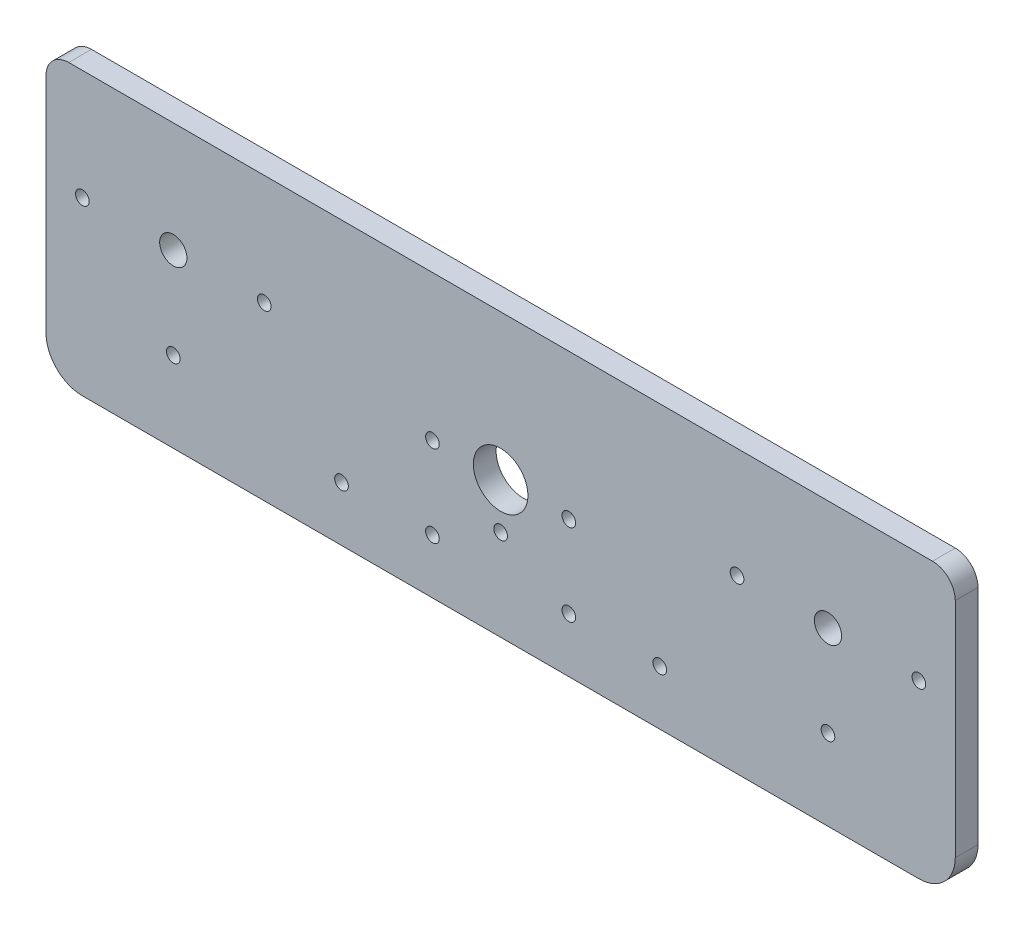
ISO-10303-21;
HEADER;
FILE_DESCRIPTION(('STEP AP214'),'2;1');
FILE_NAME('part.step','',(''),(''),'','','');
FILE_SCHEMA(('AUTOMOTIVE_DESIGN { 1 0 10303 214 1 1 1 1 }'));
ENDSEC;
DATA;
#1=APPLICATION_CONTEXT('core data for automotive mechanical design processes');
#2=APPLICATION_PROTOCOL_DEFINITION('international standard','automotive_design',2000,#1);
#3=PRODUCT_CONTEXT('',#1,'mechanical');
#4=PRODUCT('Part','Part','',(#3));
#5=PRODUCT_RELATED_PRODUCT_CATEGORY('part','',(#4));
#6=PRODUCT_DEFINITION_FORMATION('','',#4);
#7=PRODUCT_DEFINITION_CONTEXT('part definition',#1,'design');
#8=PRODUCT_DEFINITION('design','',#6,#7);
#9=PRODUCT_DEFINITION_SHAPE('','',#8);
#10=(LENGTH_UNIT() NAMED_UNIT(*) SI_UNIT(.MILLI.,.METRE.));
#11=(NAMED_UNIT(*) PLANE_ANGLE_UNIT() SI_UNIT($,.RADIAN.));
#12=(NAMED_UNIT(*) SI_UNIT($,.STERADIAN.) SOLID_ANGLE_UNIT());
#13=UNCERTAINTY_MEASURE_WITH_UNIT(LENGTH_MEASURE(1.E-05),#10,'distance_accuracy_value','');
#14=(GEOMETRIC_REPRESENTATION_CONTEXT(3) GLOBAL_UNCERTAINTY_ASSIGNED_CONTEXT((#13)) GLOBAL_UNIT_ASSIGNED_CONTEXT((#10,
#11,#12)) REPRESENTATION_CONTEXT('',''));
#15=CARTESIAN_POINT('',(0.,0.,0.));
#16=DIRECTION('',(0.,0.,1.));
#17=DIRECTION('',(1.,0.,0.));
#18=AXIS2_PLACEMENT_3D('',#15,#16,#17);
#19=CARTESIAN_POINT('',(-100.,0.,5.));
#20=DIRECTION('',(1.,0.,0.));
#21=DIRECTION('',(0.,0.,-1.));
#22=AXIS2_PLACEMENT_3D('',#19,#20,#21);
#23=PLANE('',#22);
#24=DIRECTION('',(0.,-1.,0.));
#25=VECTOR('',#24,1.);
#26=CARTESIAN_POINT('',(-100.,0.,5.));
#27=LINE('',#26,#25);
#28=CARTESIAN_POINT('',(-100.,0.,5.));
#29=VERTEX_POINT('',#28);
#30=CARTESIAN_POINT('',(-100.,-49.,5.));
#31=VERTEX_POINT('',#30);
#32=EDGE_CURVE('E106',#29,#31,#27,.T.);
#33=ORIENTED_EDGE('',*,*,#32,.F.);
#34=DIRECTION('',(0.,0.,-1.));
#35=VECTOR('',#34,1.);
#36=CARTESIAN_POINT('',(-100.,0.,0.));
#37=LINE('',#36,#35);
#38=CARTESIAN_POINT('',(-100.,0.,0.));
#39=VERTEX_POINT('',#38);
#40=EDGE_CURVE('E11',#29,#39,#37,.T.);
#41=ORIENTED_EDGE('',*,*,#40,.T.);
#42=DIRECTION('',(0.,-1.,0.));
#43=VECTOR('',#42,1.);
#44=CARTESIAN_POINT('',(-100.,0.,0.));
#45=LINE('',#44,#43);
#46=CARTESIAN_POINT('',(-100.,-49.,0.));
#47=VERTEX_POINT('',#46);
#48=EDGE_CURVE('E130',#39,#47,#45,.T.);
#49=ORIENTED_EDGE('',*,*,#48,.T.);
#50=DIRECTION('',(0.,0.,-1.));
#51=VECTOR('',#50,1.);
#52=CARTESIAN_POINT('',(-100.,-49.,5.));
#53=LINE('',#52,#51);
#54=EDGE_CURVE('E123',#31,#47,#53,.T.);
#55=ORIENTED_EDGE('',*,*,#54,.F.);
#56=EDGE_LOOP('',(#33,#41,#49,#55));
#57=FACE_BOUND('',#56,.T.);
#58=ADVANCED_FACE('F41',(#57),#23,.F.);
#59=CARTESIAN_POINT('',(-92.,-49.,5.));
#60=DIRECTION('',(0.,0.,-1.));
#61=DIRECTION('',(-1.,0.,0.));
#62=AXIS2_PLACEMENT_3D('',#59,#60,#61);
#63=CYLINDRICAL_SURFACE('',#62,8.);
#64=CARTESIAN_POINT('',(-92.,-49.,0.));
#65=DIRECTION('',(0.,0.,1.));
#66=DIRECTION('',(1.,0.,0.));
#67=AXIS2_PLACEMENT_3D('',#64,#65,#66);
#68=CIRCLE('',#67,8.);
#69=CARTESIAN_POINT('',(-92.,-57.,0.));
#70=VERTEX_POINT('',#69);
#71=EDGE_CURVE('E262',#47,#70,#68,.T.);
#72=ORIENTED_EDGE('',*,*,#71,.T.);
#73=DIRECTION('',(0.,0.,-1.));
#74=VECTOR('',#73,1.);
#75=CARTESIAN_POINT('',(-92.,-57.,5.));
#76=LINE('',#75,#74);
#77=CARTESIAN_POINT('',(-92.,-57.,5.));
#78=VERTEX_POINT('',#77);
#79=EDGE_CURVE('E124',#78,#70,#76,.T.);
#80=ORIENTED_EDGE('',*,*,#79,.F.);
#81=CARTESIAN_POINT('',(-92.,-49.,5.));
#82=DIRECTION('',(0.,0.,1.));
#83=DIRECTION('',(1.,0.,0.));
#84=AXIS2_PLACEMENT_3D('',#81,#82,#83);
#85=CIRCLE('',#84,8.);
#86=EDGE_CURVE('E111',#31,#78,#85,.T.);
#87=ORIENTED_EDGE('',*,*,#86,.F.);
#88=ORIENTED_EDGE('',*,*,#54,.T.);
#89=EDGE_LOOP('',(#72,#80,#87,#88));
#90=FACE_BOUND('',#89,.T.);
#91=ADVANCED_FACE('F122',(#90),#63,.T.);
#92=CARTESIAN_POINT('',(0.,-57.,5.));
#93=DIRECTION('',(0.,-1.,0.));
#94=DIRECTION('',(1.,0.,0.));
#95=AXIS2_PLACEMENT_3D('',#92,#93,#94);
#96=PLANE('',#95);
#97=DIRECTION('',(-1.,0.,0.));
#98=VECTOR('',#97,1.);
#99=CARTESIAN_POINT('',(0.,-57.,0.));
#100=LINE('',#99,#98);
#101=CARTESIAN_POINT('',(92.,-57.,0.));
#102=VERTEX_POINT('',#101);
#103=EDGE_CURVE('E190',#102,#70,#100,.T.);
#104=ORIENTED_EDGE('',*,*,#103,.F.);
#105=DIRECTION('',(0.,0.,-1.));
#106=VECTOR('',#105,1.);
#107=CARTESIAN_POINT('',(92.,-57.,5.));
#108=LINE('',#107,#106);
#109=CARTESIAN_POINT('',(92.,-57.,5.));
#110=VERTEX_POINT('',#109);
#111=EDGE_CURVE('E139',#110,#102,#108,.T.);
#112=ORIENTED_EDGE('',*,*,#111,.F.);
#113=DIRECTION('',(-1.,0.,0.));
#114=VECTOR('',#113,1.);
#115=CARTESIAN_POINT('',(0.,-57.,5.));
#116=LINE('',#115,#114);
#117=EDGE_CURVE('E127',#110,#78,#116,.T.);
#118=ORIENTED_EDGE('',*,*,#117,.T.);
#119=ORIENTED_EDGE('',*,*,#79,.T.);
#120=EDGE_LOOP('',(#104,#112,#118,#119));
#121=FACE_BOUND('',#120,.T.);
#122=ADVANCED_FACE('F260',(#121),#96,.T.);
#123=CARTESIAN_POINT('',(92.,-49.,5.));
#124=DIRECTION('',(0.,0.,-1.));
#125=DIRECTION('',(-1.,0.,0.));
#126=AXIS2_PLACEMENT_3D('',#123,#124,#125);
#127=CYLINDRICAL_SURFACE('',#126,8.);
#128=CARTESIAN_POINT('',(92.,-49.,0.));
#129=DIRECTION('',(0.,0.,1.));
#130=DIRECTION('',(1.,0.,0.));
#131=AXIS2_PLACEMENT_3D('',#128,#129,#130);
#132=CIRCLE('',#131,8.);
#133=CARTESIAN_POINT('',(100.,-49.,0.));
#134=VERTEX_POINT('',#133);
#135=EDGE_CURVE('E184',#134,#102,#132,.F.);
#136=ORIENTED_EDGE('',*,*,#135,.F.);
#137=DIRECTION('',(0.,0.,-1.));
#138=VECTOR('',#137,1.);
#139=CARTESIAN_POINT('',(100.,-49.,5.));
#140=LINE('',#139,#138);
#141=CARTESIAN_POINT('',(100.,-49.,5.));
#142=VERTEX_POINT('',#141);
#143=EDGE_CURVE('E181',#142,#134,#140,.T.);
#144=ORIENTED_EDGE('',*,*,#143,.F.);
#145=CARTESIAN_POINT('',(92.,-49.,5.));
#146=DIRECTION('',(0.,0.,1.));
#147=DIRECTION('',(1.,0.,0.));
#148=AXIS2_PLACEMENT_3D('',#145,#146,#147);
#149=CIRCLE('',#148,8.);
#150=EDGE_CURVE('E257',#142,#110,#149,.F.);
#151=ORIENTED_EDGE('',*,*,#150,.T.);
#152=ORIENTED_EDGE('',*,*,#111,.T.);
#153=EDGE_LOOP('',(#136,#144,#151,#152));
#154=FACE_BOUND('',#153,.T.);
#155=ADVANCED_FACE('F256',(#154),#127,.T.);
#156=CARTESIAN_POINT('',(100.,0.,5.));
#157=DIRECTION('',(1.,0.,0.));
#158=DIRECTION('',(0.,0.,-1.));
#159=AXIS2_PLACEMENT_3D('',#156,#157,#158);
#160=PLANE('',#159);
#161=DIRECTION('',(0.,-1.,0.));
#162=VECTOR('',#161,1.);
#163=CARTESIAN_POINT('',(100.,0.,0.));
#164=LINE('',#163,#162);
#165=CARTESIAN_POINT('',(100.,0.,0.));
#166=VERTEX_POINT('',#165);
#167=EDGE_CURVE('E176',#166,#134,#164,.T.);
#168=ORIENTED_EDGE('',*,*,#167,.F.);
#169=DIRECTION('',(0.,0.,-1.));
#170=VECTOR('',#169,1.);
#171=CARTESIAN_POINT('',(100.,0.,5.));
#172=LINE('',#171,#170);
#173=CARTESIAN_POINT('',(100.,0.,5.));
#174=VERTEX_POINT('',#173);
#175=EDGE_CURVE('E65',#166,#174,#172,.F.);
#176=ORIENTED_EDGE('',*,*,#175,.T.);
#177=DIRECTION('',(0.,-1.,0.));
#178=VECTOR('',#177,1.);
#179=CARTESIAN_POINT('',(100.,0.,5.));
#180=LINE('',#179,#178);
#181=EDGE_CURVE('E160',#174,#142,#180,.T.);
#182=ORIENTED_EDGE('',*,*,#181,.T.);
#183=ORIENTED_EDGE('',*,*,#143,.T.);
#184=EDGE_LOOP('',(#168,#176,#182,#183));
#185=FACE_BOUND('',#184,.T.);
#186=ADVANCED_FACE('F179',(#185),#160,.T.);
#187=CARTESIAN_POINT('',(-15.,-27.,5.));
#188=DIRECTION('',(0.,0.,-1.));
#189=DIRECTION('',(-1.,0.,0.));
#190=AXIS2_PLACEMENT_3D('',#187,#188,#189);
#191=CYLINDRICAL_SURFACE('',#190,1.5);
#192=CARTESIAN_POINT('',(-15.,-27.,5.));
#193=DIRECTION('',(0.,0.,1.));
#194=DIRECTION('',(1.,0.,0.));
#195=AXIS2_PLACEMENT_3D('',#192,#193,#194);
#196=CIRCLE('',#195,1.5);
#197=CARTESIAN_POINT('',(-13.5,-27.,5.));
#198=VERTEX_POINT('',#197);
#199=EDGE_CURVE('E279',#198,#198,#196,.T.);
#200=ORIENTED_EDGE('',*,*,#199,.T.);
#201=EDGE_LOOP('',(#200));
#202=FACE_BOUND('',#201,.T.);
#203=CARTESIAN_POINT('',(-15.,-27.,0.));
#204=DIRECTION('',(0.,0.,1.));
#205=DIRECTION('',(1.,0.,0.));
#206=AXIS2_PLACEMENT_3D('',#203,#204,#205);
#207=CIRCLE('',#206,1.5);
#208=CARTESIAN_POINT('',(-13.5,-27.,0.));
#209=VERTEX_POINT('',#208);
#210=EDGE_CURVE('E241',#209,#209,#207,.T.);
#211=ORIENTED_EDGE('',*,*,#210,.F.);
#212=EDGE_LOOP('',(#211));
#213=FACE_BOUND('',#212,.T.);
#214=ADVANCED_FACE('F383',(#202,#213),#191,.F.);
#215=CARTESIAN_POINT('',(-35.,-45.,5.));
#216=DIRECTION('',(0.,0.,-1.));
#217=DIRECTION('',(-1.,0.,0.));
#218=AXIS2_PLACEMENT_3D('',#215,#216,#217);
#219=CYLINDRICAL_SURFACE('',#218,1.5);
#220=CARTESIAN_POINT('',(-35.,-45.,5.));
#221=DIRECTION('',(0.,0.,1.));
#222=DIRECTION('',(1.,0.,0.));
#223=AXIS2_PLACEMENT_3D('',#220,#221,#222);
#224=CIRCLE('',#223,1.5);
#225=CARTESIAN_POINT('',(-33.5,-45.,5.));
#226=VERTEX_POINT('',#225);
#227=EDGE_CURVE('E283',#226,#226,#224,.F.);
#228=ORIENTED_EDGE('',*,*,#227,.F.);
#229=EDGE_LOOP('',(#228));
#230=FACE_BOUND('',#229,.T.);
#231=CARTESIAN_POINT('',(-35.,-45.,0.));
#232=DIRECTION('',(0.,0.,1.));
#233=DIRECTION('',(1.,0.,0.));
#234=AXIS2_PLACEMENT_3D('',#231,#232,#233);
#235=CIRCLE('',#234,1.5);
#236=CARTESIAN_POINT('',(-33.5,-45.,0.));
#237=VERTEX_POINT('',#236);
#238=EDGE_CURVE('E237',#237,#237,#235,.F.);
#239=ORIENTED_EDGE('',*,*,#238,.T.);
#240=EDGE_LOOP('',(#239));
#241=FACE_BOUND('',#240,.T.);
#242=ADVANCED_FACE('F386',(#230,#241),#219,.F.);
#243=CARTESIAN_POINT('',(35.,-45.,5.));
#244=DIRECTION('',(0.,0.,-1.));
#245=DIRECTION('',(-1.,0.,0.));
#246=AXIS2_PLACEMENT_3D('',#243,#244,#245);
#247=CYLINDRICAL_SURFACE('',#246,1.5);
#248=CARTESIAN_POINT('',(35.,-45.,5.));
#249=DIRECTION('',(0.,0.,1.));
#250=DIRECTION('',(1.,0.,0.));
#251=AXIS2_PLACEMENT_3D('',#248,#249,#250);
#252=CIRCLE('',#251,1.5);
#253=CARTESIAN_POINT('',(36.5,-45.,5.));
#254=VERTEX_POINT('',#253);
#255=EDGE_CURVE('E287',#254,#254,#252,.T.);
#256=ORIENTED_EDGE('',*,*,#255,.T.);
#257=EDGE_LOOP('',(#256));
#258=FACE_BOUND('',#257,.T.);
#259=CARTESIAN_POINT('',(35.,-45.,0.));
#260=DIRECTION('',(0.,0.,1.));
#261=DIRECTION('',(1.,0.,0.));
#262=AXIS2_PLACEMENT_3D('',#259,#260,#261);
#263=CIRCLE('',#262,1.5);
#264=CARTESIAN_POINT('',(36.5,-45.,0.));
#265=VERTEX_POINT('',#264);
#266=EDGE_CURVE('E233',#265,#265,#263,.T.);
#267=ORIENTED_EDGE('',*,*,#266,.F.);
#268=EDGE_LOOP('',(#267));
#269=FACE_BOUND('',#268,.T.);
#270=ADVANCED_FACE('F390',(#258,#269),#247,.F.);
#271=CARTESIAN_POINT('',(15.,-45.,5.));
#272=DIRECTION('',(0.,0.,-1.));
#273=DIRECTION('',(-1.,0.,0.));
#274=AXIS2_PLACEMENT_3D('',#271,#272,#273);
#275=CYLINDRICAL_SURFACE('',#274,1.5);
#276=CARTESIAN_POINT('',(15.,-45.,5.));
#277=DIRECTION('',(0.,0.,1.));
#278=DIRECTION('',(1.,0.,0.));
#279=AXIS2_PLACEMENT_3D('',#276,#277,#278);
#280=CIRCLE('',#279,1.5);
#281=CARTESIAN_POINT('',(16.5,-45.,5.));
#282=VERTEX_POINT('',#281);
#283=EDGE_CURVE('E291',#282,#282,#280,.T.);
#284=ORIENTED_EDGE('',*,*,#283,.T.);
#285=EDGE_LOOP('',(#284));
#286=FACE_BOUND('',#285,.T.);
#287=CARTESIAN_POINT('',(15.,-45.,0.));
#288=DIRECTION('',(0.,0.,1.));
#289=DIRECTION('',(1.,0.,0.));
#290=AXIS2_PLACEMENT_3D('',#287,#288,#289);
#291=CIRCLE('',#290,1.5);
#292=CARTESIAN_POINT('',(16.5,-45.,0.));
#293=VERTEX_POINT('',#292);
#294=EDGE_CURVE('E229',#293,#293,#291,.T.);
#295=ORIENTED_EDGE('',*,*,#294,.F.);
#296=EDGE_LOOP('',(#295));
#297=FACE_BOUND('',#296,.T.);
#298=ADVANCED_FACE('F394',(#286,#297),#275,.F.);
#299=CARTESIAN_POINT('',(-52.,-19.25,5.));
#300=DIRECTION('',(0.,0.,-1.));
#301=DIRECTION('',(-1.,0.,0.));
#302=AXIS2_PLACEMENT_3D('',#299,#300,#301);
#303=CYLINDRICAL_SURFACE('',#302,1.5);
#304=CARTESIAN_POINT('',(-52.,-19.25,5.));
#305=DIRECTION('',(0.,0.,1.));
#306=DIRECTION('',(1.,0.,0.));
#307=AXIS2_PLACEMENT_3D('',#304,#305,#306);
#308=CIRCLE('',#307,1.5);
#309=CARTESIAN_POINT('',(-50.5,-19.25,5.));
#310=VERTEX_POINT('',#309);
#311=EDGE_CURVE('E295',#310,#310,#308,.F.);
#312=ORIENTED_EDGE('',*,*,#311,.F.);
#313=EDGE_LOOP('',(#312));
#314=FACE_BOUND('',#313,.T.);
#315=CARTESIAN_POINT('',(-52.,-19.25,0.));
#316=DIRECTION('',(0.,0.,1.));
#317=DIRECTION('',(1.,0.,0.));
#318=AXIS2_PLACEMENT_3D('',#315,#316,#317);
#319=CIRCLE('',#318,1.5);
#320=CARTESIAN_POINT('',(-50.5,-19.25,0.));
#321=VERTEX_POINT('',#320);
#322=EDGE_CURVE('E225',#321,#321,#319,.F.);
#323=ORIENTED_EDGE('',*,*,#322,.T.);
#324=EDGE_LOOP('',(#323));
#325=FACE_BOUND('',#324,.T.);
#326=ADVANCED_FACE('F398',(#314,#325),#303,.F.);
#327=CARTESIAN_POINT('',(-92.,-19.25,5.));
#328=DIRECTION('',(0.,0.,-1.));
#329=DIRECTION('',(-1.,0.,0.));
#330=AXIS2_PLACEMENT_3D('',#327,#328,#329);
#331=CYLINDRICAL_SURFACE('',#330,1.5);
#332=CARTESIAN_POINT('',(-92.,-19.25,5.));
#333=DIRECTION('',(0.,0.,1.));
#334=DIRECTION('',(1.,0.,0.));
#335=AXIS2_PLACEMENT_3D('',#332,#333,#334);
#336=CIRCLE('',#335,1.5);
#337=CARTESIAN_POINT('',(-90.5,-19.25,5.));
#338=VERTEX_POINT('',#337);
#339=EDGE_CURVE('E299',#338,#338,#336,.T.);
#340=ORIENTED_EDGE('',*,*,#339,.T.);
#341=EDGE_LOOP('',(#340));
#342=FACE_BOUND('',#341,.T.);
#343=CARTESIAN_POINT('',(-92.,-19.25,0.));
#344=DIRECTION('',(0.,0.,1.));
#345=DIRECTION('',(1.,0.,0.));
#346=AXIS2_PLACEMENT_3D('',#343,#344,#345);
#347=CIRCLE('',#346,1.5);
#348=CARTESIAN_POINT('',(-90.5,-19.25,0.));
#349=VERTEX_POINT('',#348);
#350=EDGE_CURVE('E221',#349,#349,#347,.T.);
#351=ORIENTED_EDGE('',*,*,#350,.F.);
#352=EDGE_LOOP('',(#351));
#353=FACE_BOUND('',#352,.T.);
#354=ADVANCED_FACE('F402',(#342,#353),#331,.F.);
#355=CARTESIAN_POINT('',(92.,-19.25,5.));
#356=DIRECTION('',(0.,0.,-1.));
#357=DIRECTION('',(-1.,0.,0.));
#358=AXIS2_PLACEMENT_3D('',#355,#356,#357);
#359=CYLINDRICAL_SURFACE('',#358,1.5);
#360=CARTESIAN_POINT('',(92.,-19.25,5.));
#361=DIRECTION('',(0.,0.,1.));
#362=DIRECTION('',(1.,0.,0.));
#363=AXIS2_PLACEMENT_3D('',#360,#361,#362);
#364=CIRCLE('',#363,1.5);
#365=CARTESIAN_POINT('',(93.5,-19.25,5.));
#366=VERTEX_POINT('',#365);
#367=EDGE_CURVE('E303',#366,#366,#364,.F.);
#368=ORIENTED_EDGE('',*,*,#367,.F.);
#369=EDGE_LOOP('',(#368));
#370=FACE_BOUND('',#369,.T.);
#371=CARTESIAN_POINT('',(92.,-19.25,0.));
#372=DIRECTION('',(0.,0.,1.));
#373=DIRECTION('',(1.,0.,0.));
#374=AXIS2_PLACEMENT_3D('',#371,#372,#373);
#375=CIRCLE('',#374,1.5);
#376=CARTESIAN_POINT('',(93.5,-19.25,0.));
#377=VERTEX_POINT('',#376);
#378=EDGE_CURVE('E217',#377,#377,#375,.F.);
#379=ORIENTED_EDGE('',*,*,#378,.T.);
#380=EDGE_LOOP('',(#379));
#381=FACE_BOUND('',#380,.T.);
#382=ADVANCED_FACE('F406',(#370,#381),#359,.F.);
#383=CARTESIAN_POINT('',(52.,-19.25,5.));
#384=DIRECTION('',(0.,0.,-1.));
#385=DIRECTION('',(-1.,0.,0.));
#386=AXIS2_PLACEMENT_3D('',#383,#384,#385);
#387=CYLINDRICAL_SURFACE('',#386,1.5);
#388=CARTESIAN_POINT('',(52.,-19.25,5.));
#389=DIRECTION('',(0.,0.,1.));
#390=DIRECTION('',(1.,0.,0.));
#391=AXIS2_PLACEMENT_3D('',#388,#389,#390);
#392=CIRCLE('',#391,1.5);
#393=CARTESIAN_POINT('',(53.5,-19.25,5.));
#394=VERTEX_POINT('',#393);
#395=EDGE_CURVE('E307',#394,#394,#392,.T.);
#396=ORIENTED_EDGE('',*,*,#395,.T.);
#397=EDGE_LOOP('',(#396));
#398=FACE_BOUND('',#397,.T.);
#399=CARTESIAN_POINT('',(52.,-19.25,0.));
#400=DIRECTION('',(0.,0.,1.));
#401=DIRECTION('',(1.,0.,0.));
#402=AXIS2_PLACEMENT_3D('',#399,#400,#401);
#403=CIRCLE('',#402,1.5);
#404=CARTESIAN_POINT('',(53.5,-19.25,0.));
#405=VERTEX_POINT('',#404);
#406=EDGE_CURVE('E213',#405,#405,#403,.T.);
#407=ORIENTED_EDGE('',*,*,#406,.F.);
#408=EDGE_LOOP('',(#407));
#409=FACE_BOUND('',#408,.T.);
#410=ADVANCED_FACE('F410',(#398,#409),#387,.F.);
#411=CARTESIAN_POINT('',(72.,-39.25,5.));
#412=DIRECTION('',(0.,0.,-1.));
#413=DIRECTION('',(-1.,0.,0.));
#414=AXIS2_PLACEMENT_3D('',#411,#412,#413);
#415=CYLINDRICAL_SURFACE('',#414,1.5);
#416=CARTESIAN_POINT('',(72.,-39.25,5.));
#417=DIRECTION('',(0.,0.,1.));
#418=DIRECTION('',(1.,0.,0.));
#419=AXIS2_PLACEMENT_3D('',#416,#417,#418);
#420=CIRCLE('',#419,1.5);
#421=CARTESIAN_POINT('',(73.5,-39.25,5.));
#422=VERTEX_POINT('',#421);
#423=EDGE_CURVE('E311',#422,#422,#420,.T.);
#424=ORIENTED_EDGE('',*,*,#423,.T.);
#425=EDGE_LOOP('',(#424));
#426=FACE_BOUND('',#425,.T.);
#427=CARTESIAN_POINT('',(72.,-39.25,0.));
#428=DIRECTION('',(0.,0.,1.));
#429=DIRECTION('',(1.,0.,0.));
#430=AXIS2_PLACEMENT_3D('',#427,#428,#429);
#431=CIRCLE('',#430,1.5);
#432=CARTESIAN_POINT('',(73.5,-39.25,0.));
#433=VERTEX_POINT('',#432);
#434=EDGE_CURVE('E209',#433,#433,#431,.T.);
#435=ORIENTED_EDGE('',*,*,#434,.F.);
#436=EDGE_LOOP('',(#435));
#437=FACE_BOUND('',#436,.T.);
#438=ADVANCED_FACE('F414',(#426,#437),#415,.F.);
#439=CARTESIAN_POINT('',(0.,-27.,5.));
#440=DIRECTION('',(0.,0.,-1.));
#441=DIRECTION('',(-1.,0.,0.));
#442=AXIS2_PLACEMENT_3D('',#439,#440,#441);
#443=CYLINDRICAL_SURFACE('',#442,6.);
#444=CARTESIAN_POINT('',(0.,-27.,5.));
#445=DIRECTION('',(0.,0.,1.));
#446=DIRECTION('',(1.,0.,0.));
#447=AXIS2_PLACEMENT_3D('',#444,#445,#446);
#448=CIRCLE('',#447,6.);
#449=CARTESIAN_POINT('',(6.,-27.,5.));
#450=VERTEX_POINT('',#449);
#451=EDGE_CURVE('E315',#450,#450,#448,.T.);
#452=ORIENTED_EDGE('',*,*,#451,.T.);
#453=EDGE_LOOP('',(#452));
#454=FACE_BOUND('',#453,.T.);
#455=CARTESIAN_POINT('',(0.,-27.,0.));
#456=DIRECTION('',(0.,0.,1.));
#457=DIRECTION('',(1.,0.,0.));
#458=AXIS2_PLACEMENT_3D('',#455,#456,#457);
#459=CIRCLE('',#458,6.);
#460=CARTESIAN_POINT('',(6.,-27.,0.));
#461=VERTEX_POINT('',#460);
#462=EDGE_CURVE('E205',#461,#461,#459,.T.);
#463=ORIENTED_EDGE('',*,*,#462,.F.);
#464=EDGE_LOOP('',(#463));
#465=FACE_BOUND('',#464,.T.);
#466=ADVANCED_FACE('F418',(#454,#465),#443,.F.);
#467=CARTESIAN_POINT('',(72.,-19.25,5.));
#468=DIRECTION('',(0.,0.,-1.));
#469=DIRECTION('',(-1.,0.,0.));
#470=AXIS2_PLACEMENT_3D('',#467,#468,#469);
#471=CYLINDRICAL_SURFACE('',#470,3.00000000000001);
#472=CARTESIAN_POINT('',(72.,-19.25,5.));
#473=DIRECTION('',(0.,0.,1.));
#474=DIRECTION('',(1.,0.,0.));
#475=AXIS2_PLACEMENT_3D('',#472,#473,#474);
#476=CIRCLE('',#475,3.00000000000001);
#477=CARTESIAN_POINT('',(75.,-19.25,5.));
#478=VERTEX_POINT('',#477);
#479=EDGE_CURVE('E319',#478,#478,#476,.T.);
#480=ORIENTED_EDGE('',*,*,#479,.T.);
#481=EDGE_LOOP('',(#480));
#482=FACE_BOUND('',#481,.T.);
#483=CARTESIAN_POINT('',(72.,-19.25,0.));
#484=DIRECTION('',(0.,0.,1.));
#485=DIRECTION('',(1.,0.,0.));
#486=AXIS2_PLACEMENT_3D('',#483,#484,#485);
#487=CIRCLE('',#486,3.00000000000001);
#488=CARTESIAN_POINT('',(75.,-19.25,0.));
#489=VERTEX_POINT('',#488);
#490=EDGE_CURVE('E201',#489,#489,#487,.T.);
#491=ORIENTED_EDGE('',*,*,#490,.F.);
#492=EDGE_LOOP('',(#491));
#493=FACE_BOUND('',#492,.T.);
#494=ADVANCED_FACE('F422',(#482,#493),#471,.F.);
#495=CARTESIAN_POINT('',(-72.,-19.25,5.));
#496=DIRECTION('',(0.,0.,-1.));
#497=DIRECTION('',(-1.,0.,0.));
#498=AXIS2_PLACEMENT_3D('',#495,#496,#497);
#499=CYLINDRICAL_SURFACE('',#498,3.00000000000001);
#500=CARTESIAN_POINT('',(-72.,-19.25,5.));
#501=DIRECTION('',(0.,0.,1.));
#502=DIRECTION('',(1.,0.,0.));
#503=AXIS2_PLACEMENT_3D('',#500,#501,#502);
#504=CIRCLE('',#503,3.00000000000001);
#505=CARTESIAN_POINT('',(-69.,-19.25,5.));
#506=VERTEX_POINT('',#505);
#507=EDGE_CURVE('E323',#506,#506,#504,.F.);
#508=ORIENTED_EDGE('',*,*,#507,.F.);
#509=EDGE_LOOP('',(#508));
#510=FACE_BOUND('',#509,.T.);
#511=CARTESIAN_POINT('',(-72.,-19.25,0.));
#512=DIRECTION('',(0.,0.,1.));
#513=DIRECTION('',(1.,0.,0.));
#514=AXIS2_PLACEMENT_3D('',#511,#512,#513);
#515=CIRCLE('',#514,3.00000000000001);
#516=CARTESIAN_POINT('',(-69.,-19.25,0.));
#517=VERTEX_POINT('',#516);
#518=EDGE_CURVE('E197',#517,#517,#515,.F.);
#519=ORIENTED_EDGE('',*,*,#518,.T.);
#520=EDGE_LOOP('',(#519));
#521=FACE_BOUND('',#520,.T.);
#522=ADVANCED_FACE('F426',(#510,#521),#499,.F.);
#523=CARTESIAN_POINT('',(-72.,-39.25,5.));
#524=DIRECTION('',(0.,0.,-1.));
#525=DIRECTION('',(-1.,0.,0.));
#526=AXIS2_PLACEMENT_3D('',#523,#524,#525);
#527=CYLINDRICAL_SURFACE('',#526,1.5);
#528=CARTESIAN_POINT('',(-72.,-39.25,5.));
#529=DIRECTION('',(0.,0.,1.));
#530=DIRECTION('',(1.,0.,0.));
#531=AXIS2_PLACEMENT_3D('',#528,#529,#530);
#532=CIRCLE('',#531,1.5);
#533=CARTESIAN_POINT('',(-70.5,-39.25,5.));
#534=VERTEX_POINT('',#533);
#535=EDGE_CURVE('E169',#534,#534,#532,.F.);
#536=ORIENTED_EDGE('',*,*,#535,.F.);
#537=EDGE_LOOP('',(#536));
#538=FACE_BOUND('',#537,.T.);
#539=CARTESIAN_POINT('',(-72.,-39.25,0.));
#540=DIRECTION('',(0.,0.,1.));
#541=DIRECTION('',(1.,0.,0.));
#542=AXIS2_PLACEMENT_3D('',#539,#540,#541);
#543=CIRCLE('',#542,1.5);
#544=CARTESIAN_POINT('',(-70.5,-39.25,0.));
#545=VERTEX_POINT('',#544);
#546=EDGE_CURVE('E188',#545,#545,#543,.F.);
#547=ORIENTED_EDGE('',*,*,#546,.T.);
#548=EDGE_LOOP('',(#547));
#549=FACE_BOUND('',#548,.T.);
#550=ADVANCED_FACE('F430',(#538,#549),#527,.F.);
#551=CARTESIAN_POINT('',(0.,5.00000000000001,5.));
#552=DIRECTION('',(0.,1.,0.));
#553=DIRECTION('',(-1.,0.,0.));
#554=AXIS2_PLACEMENT_3D('',#551,#552,#553);
#555=PLANE('',#554);
#556=DIRECTION('',(1.,0.,0.));
#557=VECTOR('',#556,1.);
#558=CARTESIAN_POINT('',(0.,5.00000000000001,5.));
#559=LINE('',#558,#557);
#560=CARTESIAN_POINT('',(-95.,5.,5.));
#561=VERTEX_POINT('',#560);
#562=CARTESIAN_POINT('',(95.,5.00000000000002,5.));
#563=VERTEX_POINT('',#562);
#564=EDGE_CURVE('E158',#561,#563,#559,.T.);
#565=ORIENTED_EDGE('',*,*,#564,.T.);
#566=DIRECTION('',(0.,0.,-1.));
#567=VECTOR('',#566,1.);
#568=CARTESIAN_POINT('',(95.,5.00000000000002,5.));
#569=LINE('',#568,#567);
#570=CARTESIAN_POINT('',(95.,5.00000000000002,0.));
#571=VERTEX_POINT('',#570);
#572=EDGE_CURVE('E137',#563,#571,#569,.T.);
#573=ORIENTED_EDGE('',*,*,#572,.T.);
#574=DIRECTION('',(1.,0.,0.));
#575=VECTOR('',#574,1.);
#576=CARTESIAN_POINT('',(0.,5.00000000000001,0.));
#577=LINE('',#576,#575);
#578=CARTESIAN_POINT('',(-95.,5.,0.));
#579=VERTEX_POINT('',#578);
#580=EDGE_CURVE('E178',#579,#571,#577,.T.);
#581=ORIENTED_EDGE('',*,*,#580,.F.);
#582=DIRECTION('',(0.,0.,-1.));
#583=VECTOR('',#582,1.);
#584=CARTESIAN_POINT('',(-95.,5.,5.));
#585=LINE('',#584,#583);
#586=EDGE_CURVE('E133',#579,#561,#585,.F.);
#587=ORIENTED_EDGE('',*,*,#586,.T.);
#588=EDGE_LOOP('',(#565,#573,#581,#587));
#589=FACE_BOUND('',#588,.T.);
#590=ADVANCED_FACE('F164',(#589),#555,.T.);
#591=CARTESIAN_POINT('',(-15.,-45.,5.));
#592=DIRECTION('',(0.,0.,-1.));
#593=DIRECTION('',(-1.,0.,0.));
#594=AXIS2_PLACEMENT_3D('',#591,#592,#593);
#595=CYLINDRICAL_SURFACE('',#594,1.5);
#596=CARTESIAN_POINT('',(-15.,-45.,5.));
#597=DIRECTION('',(0.,0.,1.));
#598=DIRECTION('',(1.,0.,0.));
#599=AXIS2_PLACEMENT_3D('',#596,#597,#598);
#600=CIRCLE('',#599,1.5);
#601=CARTESIAN_POINT('',(-13.5,-45.,5.));
#602=VERTEX_POINT('',#601);
#603=EDGE_CURVE('E117',#602,#602,#600,.F.);
#604=ORIENTED_EDGE('',*,*,#603,.F.);
#605=EDGE_LOOP('',(#604));
#606=FACE_BOUND('',#605,.T.);
#607=CARTESIAN_POINT('',(-15.,-45.,0.));
#608=DIRECTION('',(0.,0.,1.));
#609=DIRECTION('',(1.,0.,0.));
#610=AXIS2_PLACEMENT_3D('',#607,#608,#609);
#611=CIRCLE('',#610,1.5);
#612=CARTESIAN_POINT('',(-13.5,-45.,0.));
#613=VERTEX_POINT('',#612);
#614=EDGE_CURVE('E268',#613,#613,#611,.F.);
#615=ORIENTED_EDGE('',*,*,#614,.T.);
#616=EDGE_LOOP('',(#615));
#617=FACE_BOUND('',#616,.T.);
#618=ADVANCED_FACE('F352',(#606,#617),#595,.F.);
#619=CARTESIAN_POINT('',(0.,-37.,5.));
#620=DIRECTION('',(0.,0.,-1.));
#621=DIRECTION('',(-1.,0.,0.));
#622=AXIS2_PLACEMENT_3D('',#619,#620,#621);
#623=CYLINDRICAL_SURFACE('',#622,1.5);
#624=CARTESIAN_POINT('',(0.,-37.,5.));
#625=DIRECTION('',(0.,0.,1.));
#626=DIRECTION('',(1.,0.,0.));
#627=AXIS2_PLACEMENT_3D('',#624,#625,#626);
#628=CIRCLE('',#627,1.5);
#629=CARTESIAN_POINT('',(1.50000000000001,-37.,5.));
#630=VERTEX_POINT('',#629);
#631=EDGE_CURVE('E249',#630,#630,#628,.T.);
#632=ORIENTED_EDGE('',*,*,#631,.T.);
#633=EDGE_LOOP('',(#632));
#634=FACE_BOUND('',#633,.T.);
#635=CARTESIAN_POINT('',(0.,-37.,0.));
#636=DIRECTION('',(0.,0.,1.));
#637=DIRECTION('',(1.,0.,0.));
#638=AXIS2_PLACEMENT_3D('',#635,#636,#637);
#639=CIRCLE('',#638,1.5);
#640=CARTESIAN_POINT('',(1.50000000000001,-37.,0.));
#641=VERTEX_POINT('',#640);
#642=EDGE_CURVE('E272',#641,#641,#639,.T.);
#643=ORIENTED_EDGE('',*,*,#642,.F.);
#644=EDGE_LOOP('',(#643));
#645=FACE_BOUND('',#644,.T.);
#646=ADVANCED_FACE('F343',(#634,#645),#623,.F.);
#647=CARTESIAN_POINT('',(15.,-27.,5.));
#648=DIRECTION('',(0.,0.,-1.));
#649=DIRECTION('',(-1.,0.,0.));
#650=AXIS2_PLACEMENT_3D('',#647,#648,#649);
#651=CYLINDRICAL_SURFACE('',#650,1.5);
#652=CARTESIAN_POINT('',(15.,-27.,5.));
#653=DIRECTION('',(0.,0.,1.));
#654=DIRECTION('',(1.,0.,0.));
#655=AXIS2_PLACEMENT_3D('',#652,#653,#654);
#656=CIRCLE('',#655,1.5);
#657=CARTESIAN_POINT('',(16.5,-27.,5.));
#658=VERTEX_POINT('',#657);
#659=EDGE_CURVE('E251',#658,#658,#656,.F.);
#660=ORIENTED_EDGE('',*,*,#659,.F.);
#661=EDGE_LOOP('',(#660));
#662=FACE_BOUND('',#661,.T.);
#663=CARTESIAN_POINT('',(15.,-27.,0.));
#664=DIRECTION('',(0.,0.,1.));
#665=DIRECTION('',(1.,0.,0.));
#666=AXIS2_PLACEMENT_3D('',#663,#664,#665);
#667=CIRCLE('',#666,1.5);
#668=CARTESIAN_POINT('',(16.5,-27.,0.));
#669=VERTEX_POINT('',#668);
#670=EDGE_CURVE('E245',#669,#669,#667,.F.);
#671=ORIENTED_EDGE('',*,*,#670,.T.);
#672=EDGE_LOOP('',(#671));
#673=FACE_BOUND('',#672,.T.);
#674=ADVANCED_FACE('F348',(#662,#673),#651,.F.);
#675=CARTESIAN_POINT('',(0.,0.,5.));
#676=DIRECTION('',(0.,0.,1.));
#677=DIRECTION('',(1.,0.,0.));
#678=AXIS2_PLACEMENT_3D('',#675,#676,#677);
#679=PLANE('',#678);
#680=ORIENTED_EDGE('',*,*,#631,.F.);
#681=EDGE_LOOP('',(#680));
#682=FACE_BOUND('',#681,.T.);
#683=ORIENTED_EDGE('',*,*,#603,.T.);
#684=EDGE_LOOP('',(#683));
#685=FACE_BOUND('',#684,.T.);
#686=ORIENTED_EDGE('',*,*,#181,.F.);
#687=CARTESIAN_POINT('',(95.,0.,5.));
#688=DIRECTION('',(0.,0.,1.));
#689=DIRECTION('',(1.,0.,0.));
#690=AXIS2_PLACEMENT_3D('',#687,#688,#689);
#691=CIRCLE('',#690,5.);
#692=EDGE_CURVE('E50',#174,#563,#691,.T.);
#693=ORIENTED_EDGE('',*,*,#692,.T.);
#694=ORIENTED_EDGE('',*,*,#564,.F.);
#695=CARTESIAN_POINT('',(-95.,0.,5.));
#696=DIRECTION('',(0.,0.,1.));
#697=DIRECTION('',(1.,0.,0.));
#698=AXIS2_PLACEMENT_3D('',#695,#696,#697);
#699=CIRCLE('',#698,5.);
#700=EDGE_CURVE('E57',#561,#29,#699,.T.);
#701=ORIENTED_EDGE('',*,*,#700,.T.);
#702=ORIENTED_EDGE('',*,*,#32,.T.);
#703=ORIENTED_EDGE('',*,*,#86,.T.);
#704=ORIENTED_EDGE('',*,*,#117,.F.);
#705=ORIENTED_EDGE('',*,*,#150,.F.);
#706=EDGE_LOOP('',(#686,#693,#694,#701,#702,#703,#704,#705));
#707=FACE_BOUND('',#706,.T.);
#708=ORIENTED_EDGE('',*,*,#535,.T.);
#709=EDGE_LOOP('',(#708));
#710=FACE_BOUND('',#709,.T.);
#711=ORIENTED_EDGE('',*,*,#507,.T.);
#712=EDGE_LOOP('',(#711));
#713=FACE_BOUND('',#712,.T.);
#714=ORIENTED_EDGE('',*,*,#479,.F.);
#715=EDGE_LOOP('',(#714));
#716=FACE_BOUND('',#715,.T.);
#717=ORIENTED_EDGE('',*,*,#451,.F.);
#718=EDGE_LOOP('',(#717));
#719=FACE_BOUND('',#718,.T.);
#720=ORIENTED_EDGE('',*,*,#423,.F.);
#721=EDGE_LOOP('',(#720));
#722=FACE_BOUND('',#721,.T.);
#723=ORIENTED_EDGE('',*,*,#395,.F.);
#724=EDGE_LOOP('',(#723));
#725=FACE_BOUND('',#724,.T.);
#726=ORIENTED_EDGE('',*,*,#367,.T.);
#727=EDGE_LOOP('',(#726));
#728=FACE_BOUND('',#727,.T.);
#729=ORIENTED_EDGE('',*,*,#339,.F.);
#730=EDGE_LOOP('',(#729));
#731=FACE_BOUND('',#730,.T.);
#732=ORIENTED_EDGE('',*,*,#311,.T.);
#733=EDGE_LOOP('',(#732));
#734=FACE_BOUND('',#733,.T.);
#735=ORIENTED_EDGE('',*,*,#283,.F.);
#736=EDGE_LOOP('',(#735));
#737=FACE_BOUND('',#736,.T.);
#738=ORIENTED_EDGE('',*,*,#255,.F.);
#739=EDGE_LOOP('',(#738));
#740=FACE_BOUND('',#739,.T.);
#741=ORIENTED_EDGE('',*,*,#227,.T.);
#742=EDGE_LOOP('',(#741));
#743=FACE_BOUND('',#742,.T.);
#744=ORIENTED_EDGE('',*,*,#199,.F.);
#745=EDGE_LOOP('',(#744));
#746=FACE_BOUND('',#745,.T.);
#747=ORIENTED_EDGE('',*,*,#659,.T.);
#748=EDGE_LOOP('',(#747));
#749=FACE_BOUND('',#748,.T.);
#750=ADVANCED_FACE('F108',(#682,#685,#707,#710,#713,#716,#719,#722,#725,#728,#731,#734,#737,
#740,#743,#746,#749),#679,.T.);
#751=CARTESIAN_POINT('',(0.,0.,0.));
#752=DIRECTION('',(0.,0.,1.));
#753=DIRECTION('',(1.,0.,0.));
#754=AXIS2_PLACEMENT_3D('',#751,#752,#753);
#755=PLANE('',#754);
#756=ORIENTED_EDGE('',*,*,#642,.T.);
#757=EDGE_LOOP('',(#756));
#758=FACE_BOUND('',#757,.T.);
#759=ORIENTED_EDGE('',*,*,#614,.F.);
#760=EDGE_LOOP('',(#759));
#761=FACE_BOUND('',#760,.T.);
#762=ORIENTED_EDGE('',*,*,#580,.T.);
#763=CARTESIAN_POINT('',(95.,0.,0.));
#764=DIRECTION('',(0.,0.,1.));
#765=DIRECTION('',(1.,0.,0.));
#766=AXIS2_PLACEMENT_3D('',#763,#764,#765);
#767=CIRCLE('',#766,5.);
#768=EDGE_CURVE('E149',#571,#166,#767,.F.);
#769=ORIENTED_EDGE('',*,*,#768,.T.);
#770=ORIENTED_EDGE('',*,*,#167,.T.);
#771=ORIENTED_EDGE('',*,*,#135,.T.);
#772=ORIENTED_EDGE('',*,*,#103,.T.);
#773=ORIENTED_EDGE('',*,*,#71,.F.);
#774=ORIENTED_EDGE('',*,*,#48,.F.);
#775=CARTESIAN_POINT('',(-95.,0.,0.));
#776=DIRECTION('',(0.,0.,1.));
#777=DIRECTION('',(1.,0.,0.));
#778=AXIS2_PLACEMENT_3D('',#775,#776,#777);
#779=CIRCLE('',#778,5.);
#780=EDGE_CURVE('E146',#39,#579,#779,.F.);
#781=ORIENTED_EDGE('',*,*,#780,.T.);
#782=EDGE_LOOP('',(#762,#769,#770,#771,#772,#773,#774,#781));
#783=FACE_BOUND('',#782,.T.);
#784=ORIENTED_EDGE('',*,*,#546,.F.);
#785=EDGE_LOOP('',(#784));
#786=FACE_BOUND('',#785,.T.);
#787=ORIENTED_EDGE('',*,*,#518,.F.);
#788=EDGE_LOOP('',(#787));
#789=FACE_BOUND('',#788,.T.);
#790=ORIENTED_EDGE('',*,*,#490,.T.);
#791=EDGE_LOOP('',(#790));
#792=FACE_BOUND('',#791,.T.);
#793=ORIENTED_EDGE('',*,*,#462,.T.);
#794=EDGE_LOOP('',(#793));
#795=FACE_BOUND('',#794,.T.);
#796=ORIENTED_EDGE('',*,*,#434,.T.);
#797=EDGE_LOOP('',(#796));
#798=FACE_BOUND('',#797,.T.);
#799=ORIENTED_EDGE('',*,*,#406,.T.);
#800=EDGE_LOOP('',(#799));
#801=FACE_BOUND('',#800,.T.);
#802=ORIENTED_EDGE('',*,*,#378,.F.);
#803=EDGE_LOOP('',(#802));
#804=FACE_BOUND('',#803,.T.);
#805=ORIENTED_EDGE('',*,*,#350,.T.);
#806=EDGE_LOOP('',(#805));
#807=FACE_BOUND('',#806,.T.);
#808=ORIENTED_EDGE('',*,*,#322,.F.);
#809=EDGE_LOOP('',(#808));
#810=FACE_BOUND('',#809,.T.);
#811=ORIENTED_EDGE('',*,*,#294,.T.);
#812=EDGE_LOOP('',(#811));
#813=FACE_BOUND('',#812,.T.);
#814=ORIENTED_EDGE('',*,*,#266,.T.);
#815=EDGE_LOOP('',(#814));
#816=FACE_BOUND('',#815,.T.);
#817=ORIENTED_EDGE('',*,*,#238,.F.);
#818=EDGE_LOOP('',(#817));
#819=FACE_BOUND('',#818,.T.);
#820=ORIENTED_EDGE('',*,*,#210,.T.);
#821=EDGE_LOOP('',(#820));
#822=FACE_BOUND('',#821,.T.);
#823=ORIENTED_EDGE('',*,*,#670,.F.);
#824=EDGE_LOOP('',(#823));
#825=FACE_BOUND('',#824,.T.);
#826=ADVANCED_FACE('F173',(#758,#761,#783,#786,#789,#792,#795,#798,#801,#804,#807,#810,#813,
#816,#819,#822,#825),#755,.F.);
#827=CARTESIAN_POINT('',(95.,0.,5.));
#828=DIRECTION('',(0.,0.,-1.));
#829=DIRECTION('',(-1.,0.,0.));
#830=AXIS2_PLACEMENT_3D('',#827,#828,#829);
#831=CYLINDRICAL_SURFACE('',#830,5.);
#832=ORIENTED_EDGE('',*,*,#692,.F.);
#833=ORIENTED_EDGE('',*,*,#175,.F.);
#834=ORIENTED_EDGE('',*,*,#768,.F.);
#835=ORIENTED_EDGE('',*,*,#572,.F.);
#836=EDGE_LOOP('',(#832,#833,#834,#835));
#837=FACE_BOUND('',#836,.T.);
#838=ADVANCED_FACE('F171',(#837),#831,.T.);
#839=CARTESIAN_POINT('',(-95.,0.,5.));
#840=DIRECTION('',(0.,0.,1.));
#841=DIRECTION('',(1.,0.,0.));
#842=AXIS2_PLACEMENT_3D('',#839,#840,#841);
#843=CYLINDRICAL_SURFACE('',#842,5.);
#844=ORIENTED_EDGE('',*,*,#700,.F.);
#845=ORIENTED_EDGE('',*,*,#586,.F.);
#846=ORIENTED_EDGE('',*,*,#780,.F.);
#847=ORIENTED_EDGE('',*,*,#40,.F.);
#848=EDGE_LOOP('',(#844,#845,#846,#847));
#849=FACE_BOUND('',#848,.T.);
#850=ADVANCED_FACE('F43',(#849),#843,.T.);
#851=CLOSED_SHELL('',(#58,#91,#122,#155,#186,#214,#242,#270,#298,#326,#354,#382,#410,#438,#466,
#494,#522,#550,#590,#618,#646,#674,#750,#826,#838,#850));
#852=MANIFOLD_SOLID_BREP('B2',#851);
#853=ADVANCED_BREP_SHAPE_REPRESENTATION('',(#18,#852),#14);
#854=SHAPE_DEFINITION_REPRESENTATION(#9,#853);
ENDSEC;
END-ISO-10303-21;
